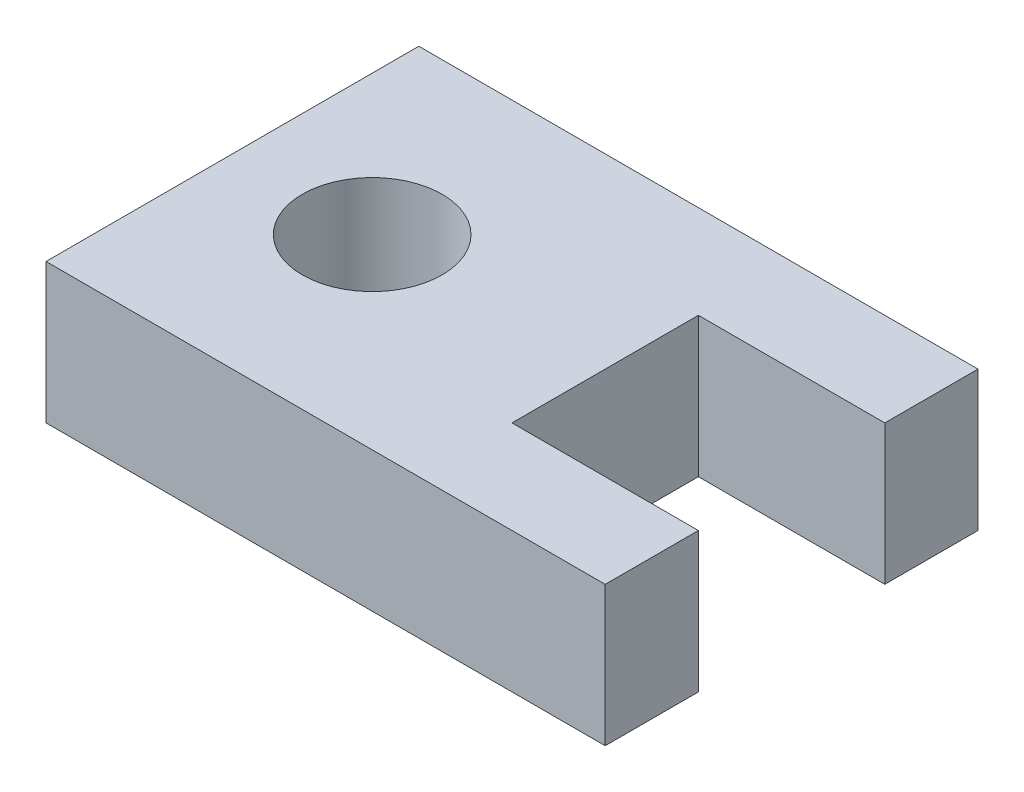
ISO-10303-21;
HEADER;
FILE_DESCRIPTION(('STEP AP214'),'2;1');
FILE_NAME('part.step','',(''),(''),'','','');
FILE_SCHEMA(('AUTOMOTIVE_DESIGN { 1 0 10303 214 1 1 1 1 }'));
ENDSEC;
DATA;
#1=APPLICATION_CONTEXT('core data for automotive mechanical design processes');
#2=APPLICATION_PROTOCOL_DEFINITION('international standard','automotive_design',2000,#1);
#3=PRODUCT_CONTEXT('',#1,'mechanical');
#4=PRODUCT('Part','Part','',(#3));
#5=PRODUCT_RELATED_PRODUCT_CATEGORY('part','',(#4));
#6=PRODUCT_DEFINITION_FORMATION('','',#4);
#7=PRODUCT_DEFINITION_CONTEXT('part definition',#1,'design');
#8=PRODUCT_DEFINITION('design','',#6,#7);
#9=PRODUCT_DEFINITION_SHAPE('','',#8);
#10=(LENGTH_UNIT() NAMED_UNIT(*) SI_UNIT(.MILLI.,.METRE.));
#11=(NAMED_UNIT(*) PLANE_ANGLE_UNIT() SI_UNIT($,.RADIAN.));
#12=(NAMED_UNIT(*) SI_UNIT($,.STERADIAN.) SOLID_ANGLE_UNIT());
#13=UNCERTAINTY_MEASURE_WITH_UNIT(LENGTH_MEASURE(1.E-05),#10,'distance_accuracy_value','');
#14=(GEOMETRIC_REPRESENTATION_CONTEXT(3) GLOBAL_UNCERTAINTY_ASSIGNED_CONTEXT((#13)) GLOBAL_UNIT_ASSIGNED_CONTEXT((#10,
#11,#12)) REPRESENTATION_CONTEXT('',''));
#15=CARTESIAN_POINT('',(0.,0.,0.));
#16=DIRECTION('',(0.,0.,1.));
#17=DIRECTION('',(1.,0.,0.));
#18=AXIS2_PLACEMENT_3D('',#15,#16,#17);
#19=CARTESIAN_POINT('',(30.,15.,-20.));
#20=DIRECTION('',(-1.,0.,0.));
#21=DIRECTION('',(0.,0.,1.));
#22=AXIS2_PLACEMENT_3D('',#19,#20,#21);
#23=PLANE('',#22);
#24=DIRECTION('',(0.,0.,-1.));
#25=VECTOR('',#24,1.);
#26=CARTESIAN_POINT('',(30.,0.,-20.));
#27=LINE('',#26,#25);
#28=CARTESIAN_POINT('',(30.,0.,20.));
#29=VERTEX_POINT('',#28);
#30=CARTESIAN_POINT('',(30.,0.,10.));
#31=VERTEX_POINT('',#30);
#32=EDGE_CURVE('E139',#29,#31,#27,.T.);
#33=ORIENTED_EDGE('',*,*,#32,.T.);
#34=DIRECTION('',(0.,1.,0.));
#35=VECTOR('',#34,1.);
#36=CARTESIAN_POINT('',(30.,-0.001000000000001,10.));
#37=LINE('',#36,#35);
#38=CARTESIAN_POINT('',(30.,15.,10.));
#39=VERTEX_POINT('',#38);
#40=EDGE_CURVE('E125',#31,#39,#37,.T.);
#41=ORIENTED_EDGE('',*,*,#40,.T.);
#42=DIRECTION('',(0.,0.,-1.));
#43=VECTOR('',#42,1.);
#44=CARTESIAN_POINT('',(30.,15.,-20.));
#45=LINE('',#44,#43);
#46=CARTESIAN_POINT('',(30.,15.,20.));
#47=VERTEX_POINT('',#46);
#48=EDGE_CURVE('E166',#47,#39,#45,.T.);
#49=ORIENTED_EDGE('',*,*,#48,.F.);
#50=DIRECTION('',(0.,-1.,0.));
#51=VECTOR('',#50,1.);
#52=CARTESIAN_POINT('',(30.,15.,20.));
#53=LINE('',#52,#51);
#54=EDGE_CURVE('E49',#47,#29,#53,.T.);
#55=ORIENTED_EDGE('',*,*,#54,.T.);
#56=EDGE_LOOP('',(#33,#41,#49,#55));
#57=FACE_BOUND('',#56,.T.);
#58=ADVANCED_FACE('F40',(#57),#23,.F.);
#59=CARTESIAN_POINT('',(-30.,15.,-20.));
#60=DIRECTION('',(1.,0.,0.));
#61=DIRECTION('',(0.,0.,-1.));
#62=AXIS2_PLACEMENT_3D('',#59,#60,#61);
#63=PLANE('',#62);
#64=DIRECTION('',(0.,0.,1.));
#65=VECTOR('',#64,1.);
#66=CARTESIAN_POINT('',(-30.,0.,-20.));
#67=LINE('',#66,#65);
#68=CARTESIAN_POINT('',(-30.,0.,-20.));
#69=VERTEX_POINT('',#68);
#70=CARTESIAN_POINT('',(-30.,0.,20.));
#71=VERTEX_POINT('',#70);
#72=EDGE_CURVE('E146',#69,#71,#67,.T.);
#73=ORIENTED_EDGE('',*,*,#72,.T.);
#74=DIRECTION('',(0.,-1.,0.));
#75=VECTOR('',#74,1.);
#76=CARTESIAN_POINT('',(-30.,15.,20.));
#77=LINE('',#76,#75);
#78=CARTESIAN_POINT('',(-30.,15.,20.));
#79=VERTEX_POINT('',#78);
#80=EDGE_CURVE('E11',#79,#71,#77,.T.);
#81=ORIENTED_EDGE('',*,*,#80,.F.);
#82=DIRECTION('',(0.,0.,1.));
#83=VECTOR('',#82,1.);
#84=CARTESIAN_POINT('',(-30.,15.,-20.));
#85=LINE('',#84,#83);
#86=CARTESIAN_POINT('',(-30.,15.,-20.));
#87=VERTEX_POINT('',#86);
#88=EDGE_CURVE('E152',#87,#79,#85,.T.);
#89=ORIENTED_EDGE('',*,*,#88,.F.);
#90=DIRECTION('',(0.,-1.,0.));
#91=VECTOR('',#90,1.);
#92=CARTESIAN_POINT('',(-30.,15.,-20.));
#93=LINE('',#92,#91);
#94=EDGE_CURVE('E153',#87,#69,#93,.T.);
#95=ORIENTED_EDGE('',*,*,#94,.T.);
#96=EDGE_LOOP('',(#73,#81,#89,#95));
#97=FACE_BOUND('',#96,.T.);
#98=ADVANCED_FACE('F42',(#97),#63,.F.);
#99=CARTESIAN_POINT('',(-30.,15.,20.));
#100=DIRECTION('',(0.,0.,-1.));
#101=DIRECTION('',(-1.,0.,0.));
#102=AXIS2_PLACEMENT_3D('',#99,#100,#101);
#103=PLANE('',#102);
#104=DIRECTION('',(1.,0.,0.));
#105=VECTOR('',#104,1.);
#106=CARTESIAN_POINT('',(-30.,0.,20.));
#107=LINE('',#106,#105);
#108=EDGE_CURVE('E140',#71,#29,#107,.T.);
#109=ORIENTED_EDGE('',*,*,#108,.T.);
#110=ORIENTED_EDGE('',*,*,#54,.F.);
#111=DIRECTION('',(1.,0.,0.));
#112=VECTOR('',#111,1.);
#113=CARTESIAN_POINT('',(-30.,15.,20.));
#114=LINE('',#113,#112);
#115=EDGE_CURVE('E93',#79,#47,#114,.T.);
#116=ORIENTED_EDGE('',*,*,#115,.F.);
#117=ORIENTED_EDGE('',*,*,#80,.T.);
#118=EDGE_LOOP('',(#109,#110,#116,#117));
#119=FACE_BOUND('',#118,.T.);
#120=ADVANCED_FACE('F222',(#119),#103,.F.);
#121=CARTESIAN_POINT('',(30.,15.,-10.));
#122=VERTEX_POINT('',#121);
#123=CARTESIAN_POINT('',(30.,15.,-20.));
#124=VERTEX_POINT('',#123);
#125=EDGE_CURVE('E132',#122,#124,#45,.T.);
#126=ORIENTED_EDGE('',*,*,#125,.F.);
#127=DIRECTION('',(0.,1.,0.));
#128=VECTOR('',#127,1.);
#129=CARTESIAN_POINT('',(30.,-0.001000000000001,-10.));
#130=LINE('',#129,#128);
#131=CARTESIAN_POINT('',(30.,0.,-10.));
#132=VERTEX_POINT('',#131);
#133=EDGE_CURVE('E118',#132,#122,#130,.T.);
#134=ORIENTED_EDGE('',*,*,#133,.F.);
#135=CARTESIAN_POINT('',(30.,0.,-20.));
#136=VERTEX_POINT('',#135);
#137=EDGE_CURVE('E131',#132,#136,#27,.T.);
#138=ORIENTED_EDGE('',*,*,#137,.T.);
#139=DIRECTION('',(0.,-1.,0.));
#140=VECTOR('',#139,1.);
#141=CARTESIAN_POINT('',(30.,15.,-20.));
#142=LINE('',#141,#140);
#143=EDGE_CURVE('E156',#124,#136,#142,.T.);
#144=ORIENTED_EDGE('',*,*,#143,.F.);
#145=EDGE_LOOP('',(#126,#134,#138,#144));
#146=FACE_BOUND('',#145,.T.);
#147=ADVANCED_FACE('F129',(#146),#23,.F.);
#148=CARTESIAN_POINT('',(-30.,15.,-20.));
#149=DIRECTION('',(0.,0.,1.));
#150=DIRECTION('',(1.,0.,0.));
#151=AXIS2_PLACEMENT_3D('',#148,#149,#150);
#152=PLANE('',#151);
#153=DIRECTION('',(-1.,0.,0.));
#154=VECTOR('',#153,1.);
#155=CARTESIAN_POINT('',(-30.,0.,-20.));
#156=LINE('',#155,#154);
#157=EDGE_CURVE('E86',#136,#69,#156,.T.);
#158=ORIENTED_EDGE('',*,*,#157,.T.);
#159=ORIENTED_EDGE('',*,*,#94,.F.);
#160=DIRECTION('',(-1.,0.,0.));
#161=VECTOR('',#160,1.);
#162=CARTESIAN_POINT('',(-30.,15.,-20.));
#163=LINE('',#162,#161);
#164=EDGE_CURVE('E65',#124,#87,#163,.T.);
#165=ORIENTED_EDGE('',*,*,#164,.F.);
#166=ORIENTED_EDGE('',*,*,#143,.T.);
#167=EDGE_LOOP('',(#158,#159,#165,#166));
#168=FACE_BOUND('',#167,.T.);
#169=ADVANCED_FACE('F213',(#168),#152,.F.);
#170=CARTESIAN_POINT('',(0.,15.,0.));
#171=DIRECTION('',(0.,1.,0.));
#172=DIRECTION('',(0.,0.,1.));
#173=AXIS2_PLACEMENT_3D('',#170,#171,#172);
#174=PLANE('',#173);
#175=DIRECTION('',(1.,0.,0.));
#176=VECTOR('',#175,1.);
#177=CARTESIAN_POINT('',(30.,15.,10.));
#178=LINE('',#177,#176);
#179=CARTESIAN_POINT('',(10.,15.,10.));
#180=VERTEX_POINT('',#179);
#181=EDGE_CURVE('E134',#180,#39,#178,.T.);
#182=ORIENTED_EDGE('',*,*,#181,.F.);
#183=DIRECTION('',(0.,0.,1.));
#184=VECTOR('',#183,1.);
#185=CARTESIAN_POINT('',(10.,15.,-10.));
#186=LINE('',#185,#184);
#187=CARTESIAN_POINT('',(10.,15.,-10.));
#188=VERTEX_POINT('',#187);
#189=EDGE_CURVE('E177',#188,#180,#186,.T.);
#190=ORIENTED_EDGE('',*,*,#189,.F.);
#191=DIRECTION('',(-1.,0.,0.));
#192=VECTOR('',#191,1.);
#193=CARTESIAN_POINT('',(30.,15.,-10.));
#194=LINE('',#193,#192);
#195=EDGE_CURVE('E172',#122,#188,#194,.T.);
#196=ORIENTED_EDGE('',*,*,#195,.F.);
#197=ORIENTED_EDGE('',*,*,#125,.T.);
#198=ORIENTED_EDGE('',*,*,#164,.T.);
#199=ORIENTED_EDGE('',*,*,#88,.T.);
#200=ORIENTED_EDGE('',*,*,#115,.T.);
#201=ORIENTED_EDGE('',*,*,#48,.T.);
#202=EDGE_LOOP('',(#182,#190,#196,#197,#198,#199,#200,#201));
#203=FACE_BOUND('',#202,.T.);
#204=CARTESIAN_POINT('',(-15.,15.,0.));
#205=DIRECTION('',(0.,1.,0.));
#206=DIRECTION('',(0.,0.,1.));
#207=AXIS2_PLACEMENT_3D('',#204,#205,#206);
#208=CIRCLE('',#207,7.5);
#209=CARTESIAN_POINT('',(-15.,15.,7.5));
#210=VERTEX_POINT('',#209);
#211=EDGE_CURVE('E124',#210,#210,#208,.T.);
#212=ORIENTED_EDGE('',*,*,#211,.F.);
#213=EDGE_LOOP('',(#212));
#214=FACE_BOUND('',#213,.T.);
#215=ADVANCED_FACE('F215',(#203,#214),#174,.T.);
#216=CARTESIAN_POINT('',(0.,0.,0.));
#217=DIRECTION('',(0.,1.,0.));
#218=DIRECTION('',(0.,0.,1.));
#219=AXIS2_PLACEMENT_3D('',#216,#217,#218);
#220=PLANE('',#219);
#221=CARTESIAN_POINT('',(-15.,0.,0.));
#222=DIRECTION('',(0.,1.,0.));
#223=DIRECTION('',(0.,0.,1.));
#224=AXIS2_PLACEMENT_3D('',#221,#222,#223);
#225=CIRCLE('',#224,7.5);
#226=CARTESIAN_POINT('',(-15.,0.,7.5));
#227=VERTEX_POINT('',#226);
#228=EDGE_CURVE('E196',#227,#227,#225,.F.);
#229=ORIENTED_EDGE('',*,*,#228,.F.);
#230=EDGE_LOOP('',(#229));
#231=FACE_BOUND('',#230,.T.);
#232=DIRECTION('',(0.,0.,-1.));
#233=VECTOR('',#232,1.);
#234=CARTESIAN_POINT('',(10.,0.,-10.));
#235=LINE('',#234,#233);
#236=CARTESIAN_POINT('',(10.,0.,10.));
#237=VERTEX_POINT('',#236);
#238=CARTESIAN_POINT('',(10.,0.,-10.));
#239=VERTEX_POINT('',#238);
#240=EDGE_CURVE('E56',#237,#239,#235,.T.);
#241=ORIENTED_EDGE('',*,*,#240,.F.);
#242=DIRECTION('',(-1.,0.,0.));
#243=VECTOR('',#242,1.);
#244=CARTESIAN_POINT('',(30.,0.,10.));
#245=LINE('',#244,#243);
#246=EDGE_CURVE('E169',#31,#237,#245,.T.);
#247=ORIENTED_EDGE('',*,*,#246,.F.);
#248=ORIENTED_EDGE('',*,*,#32,.F.);
#249=ORIENTED_EDGE('',*,*,#108,.F.);
#250=ORIENTED_EDGE('',*,*,#72,.F.);
#251=ORIENTED_EDGE('',*,*,#157,.F.);
#252=ORIENTED_EDGE('',*,*,#137,.F.);
#253=DIRECTION('',(1.,0.,0.));
#254=VECTOR('',#253,1.);
#255=CARTESIAN_POINT('',(30.,0.,-10.));
#256=LINE('',#255,#254);
#257=EDGE_CURVE('E114',#239,#132,#256,.T.);
#258=ORIENTED_EDGE('',*,*,#257,.F.);
#259=EDGE_LOOP('',(#241,#247,#248,#249,#250,#251,#252,#258));
#260=FACE_BOUND('',#259,.T.);
#261=ADVANCED_FACE('F136',(#231,#260),#220,.F.);
#262=CARTESIAN_POINT('',(-15.,-0.001000000000001,0.));
#263=DIRECTION('',(0.,1.,0.));
#264=DIRECTION('',(0.,0.,1.));
#265=AXIS2_PLACEMENT_3D('',#262,#263,#264);
#266=CYLINDRICAL_SURFACE('',#265,7.5);
#267=ORIENTED_EDGE('',*,*,#211,.T.);
#268=EDGE_LOOP('',(#267));
#269=FACE_BOUND('',#268,.T.);
#270=ORIENTED_EDGE('',*,*,#228,.T.);
#271=EDGE_LOOP('',(#270));
#272=FACE_BOUND('',#271,.T.);
#273=ADVANCED_FACE('F257',(#269,#272),#266,.F.);
#274=CARTESIAN_POINT('',(30.,-0.001000000000001,10.));
#275=DIRECTION('',(0.,0.,1.));
#276=DIRECTION('',(1.,0.,0.));
#277=AXIS2_PLACEMENT_3D('',#274,#275,#276);
#278=PLANE('',#277);
#279=ORIENTED_EDGE('',*,*,#246,.T.);
#280=DIRECTION('',(0.,1.,0.));
#281=VECTOR('',#280,1.);
#282=CARTESIAN_POINT('',(10.,-0.001000000000001,10.));
#283=LINE('',#282,#281);
#284=EDGE_CURVE('E188',#237,#180,#283,.T.);
#285=ORIENTED_EDGE('',*,*,#284,.T.);
#286=ORIENTED_EDGE('',*,*,#181,.T.);
#287=ORIENTED_EDGE('',*,*,#40,.F.);
#288=EDGE_LOOP('',(#279,#285,#286,#287));
#289=FACE_BOUND('',#288,.T.);
#290=ADVANCED_FACE('F266',(#289),#278,.F.);
#291=CARTESIAN_POINT('',(10.,-0.001000000000001,-10.));
#292=DIRECTION('',(-1.,0.,0.));
#293=DIRECTION('',(0.,0.,1.));
#294=AXIS2_PLACEMENT_3D('',#291,#292,#293);
#295=PLANE('',#294);
#296=ORIENTED_EDGE('',*,*,#240,.T.);
#297=DIRECTION('',(0.,1.,0.));
#298=VECTOR('',#297,1.);
#299=CARTESIAN_POINT('',(10.,-0.001000000000001,-10.));
#300=LINE('',#299,#298);
#301=EDGE_CURVE('E120',#239,#188,#300,.T.);
#302=ORIENTED_EDGE('',*,*,#301,.T.);
#303=ORIENTED_EDGE('',*,*,#189,.T.);
#304=ORIENTED_EDGE('',*,*,#284,.F.);
#305=EDGE_LOOP('',(#296,#302,#303,#304));
#306=FACE_BOUND('',#305,.T.);
#307=ADVANCED_FACE('F277',(#306),#295,.F.);
#308=CARTESIAN_POINT('',(30.,-0.001000000000001,-10.));
#309=DIRECTION('',(0.,0.,-1.));
#310=DIRECTION('',(-1.,0.,0.));
#311=AXIS2_PLACEMENT_3D('',#308,#309,#310);
#312=PLANE('',#311);
#313=ORIENTED_EDGE('',*,*,#257,.T.);
#314=ORIENTED_EDGE('',*,*,#133,.T.);
#315=ORIENTED_EDGE('',*,*,#195,.T.);
#316=ORIENTED_EDGE('',*,*,#301,.F.);
#317=EDGE_LOOP('',(#313,#314,#315,#316));
#318=FACE_BOUND('',#317,.T.);
#319=ADVANCED_FACE('F116',(#318),#312,.F.);
#320=CLOSED_SHELL('',(#58,#98,#120,#147,#169,#215,#261,#273,#290,#307,#319));
#321=MANIFOLD_SOLID_BREP('B2',#320);
#322=ADVANCED_BREP_SHAPE_REPRESENTATION('',(#18,#321),#14);
#323=SHAPE_DEFINITION_REPRESENTATION(#9,#322);
ENDSEC;
END-ISO-10303-21;
